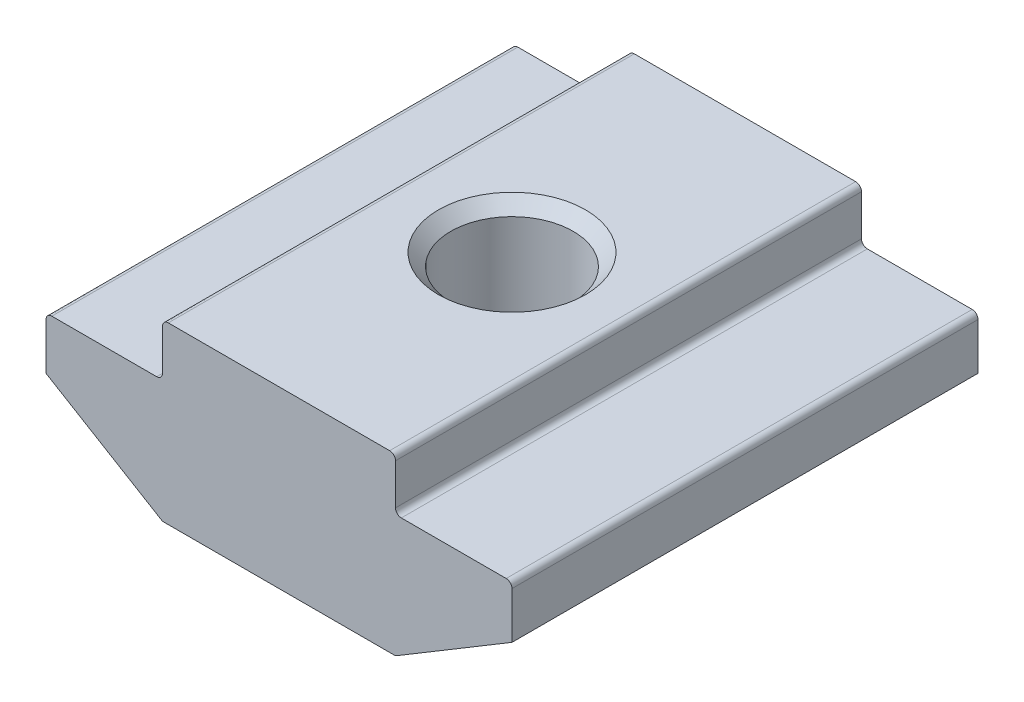
ISO-10303-21;
HEADER;
FILE_DESCRIPTION(('STEP AP214'),'2;1');
FILE_NAME('part.step','',(''),(''),'','','');
FILE_SCHEMA(('AUTOMOTIVE_DESIGN { 1 0 10303 214 1 1 1 1 }'));
ENDSEC;
DATA;
#1=APPLICATION_CONTEXT('core data for automotive mechanical design processes');
#2=APPLICATION_PROTOCOL_DEFINITION('international standard','automotive_design',2000,#1);
#3=PRODUCT_CONTEXT('',#1,'mechanical');
#4=PRODUCT('Part','Part','',(#3));
#5=PRODUCT_RELATED_PRODUCT_CATEGORY('part','',(#4));
#6=PRODUCT_DEFINITION_FORMATION('','',#4);
#7=PRODUCT_DEFINITION_CONTEXT('part definition',#1,'design');
#8=PRODUCT_DEFINITION('design','',#6,#7);
#9=PRODUCT_DEFINITION_SHAPE('','',#8);
#10=(LENGTH_UNIT() NAMED_UNIT(*) SI_UNIT(.MILLI.,.METRE.));
#11=(NAMED_UNIT(*) PLANE_ANGLE_UNIT() SI_UNIT($,.RADIAN.));
#12=(NAMED_UNIT(*) SI_UNIT($,.STERADIAN.) SOLID_ANGLE_UNIT());
#13=UNCERTAINTY_MEASURE_WITH_UNIT(LENGTH_MEASURE(1.E-05),#10,'distance_accuracy_value','');
#14=(GEOMETRIC_REPRESENTATION_CONTEXT(3) GLOBAL_UNCERTAINTY_ASSIGNED_CONTEXT((#13)) GLOBAL_UNIT_ASSIGNED_CONTEXT((#10,
#11,#12)) REPRESENTATION_CONTEXT('',''));
#15=CARTESIAN_POINT('',(0.,0.,0.));
#16=DIRECTION('',(0.,0.,1.));
#17=DIRECTION('',(1.,0.,0.));
#18=AXIS2_PLACEMENT_3D('',#15,#16,#17);
#19=CARTESIAN_POINT('',(-4.,0.,8.));
#20=DIRECTION('',(1.,0.,0.));
#21=DIRECTION('',(0.,0.,-1.));
#22=AXIS2_PLACEMENT_3D('',#19,#20,#21);
#23=PLANE('',#22);
#24=DIRECTION('',(0.,-1.,0.));
#25=VECTOR('',#24,1.);
#26=CARTESIAN_POINT('',(-4.,0.,8.));
#27=LINE('',#26,#25);
#28=CARTESIAN_POINT('',(-4.,-0.200000000000002,8.));
#29=VERTEX_POINT('',#28);
#30=CARTESIAN_POINT('',(-4.,-1.6,8.));
#31=VERTEX_POINT('',#30);
#32=EDGE_CURVE('E234',#29,#31,#27,.T.);
#33=ORIENTED_EDGE('',*,*,#32,.F.);
#34=DIRECTION('',(0.,0.,-1.));
#35=VECTOR('',#34,1.);
#36=CARTESIAN_POINT('',(-4.,-0.200000000000002,8.));
#37=LINE('',#36,#35);
#38=CARTESIAN_POINT('',(-4.,-0.200000000000002,-8.));
#39=VERTEX_POINT('',#38);
#40=EDGE_CURVE('E285',#29,#39,#37,.T.);
#41=ORIENTED_EDGE('',*,*,#40,.T.);
#42=DIRECTION('',(0.,-1.,0.));
#43=VECTOR('',#42,1.);
#44=CARTESIAN_POINT('',(-4.,0.,-8.));
#45=LINE('',#44,#43);
#46=CARTESIAN_POINT('',(-4.,-1.6,-8.));
#47=VERTEX_POINT('',#46);
#48=EDGE_CURVE('E208',#39,#47,#45,.T.);
#49=ORIENTED_EDGE('',*,*,#48,.T.);
#50=DIRECTION('',(0.,0.,-1.));
#51=VECTOR('',#50,1.);
#52=CARTESIAN_POINT('',(-4.,-1.6,8.));
#53=LINE('',#52,#51);
#54=EDGE_CURVE('E283',#47,#31,#53,.F.);
#55=ORIENTED_EDGE('',*,*,#54,.T.);
#56=EDGE_LOOP('',(#33,#41,#49,#55));
#57=FACE_BOUND('',#56,.T.);
#58=ADVANCED_FACE('F37',(#57),#23,.F.);
#59=CARTESIAN_POINT('',(-4.,-1.8,8.));
#60=DIRECTION('',(0.,-1.,0.));
#61=DIRECTION('',(1.,0.,0.));
#62=AXIS2_PLACEMENT_3D('',#59,#60,#61);
#63=PLANE('',#62);
#64=DIRECTION('',(-1.,0.,0.));
#65=VECTOR('',#64,1.);
#66=CARTESIAN_POINT('',(-4.,-1.8,-8.));
#67=LINE('',#66,#65);
#68=CARTESIAN_POINT('',(-4.2,-1.8,-8.));
#69=VERTEX_POINT('',#68);
#70=CARTESIAN_POINT('',(-7.8,-1.8,-8.));
#71=VERTEX_POINT('',#70);
#72=EDGE_CURVE('E211',#69,#71,#67,.T.);
#73=ORIENTED_EDGE('',*,*,#72,.T.);
#74=DIRECTION('',(0.,0.,-1.));
#75=VECTOR('',#74,1.);
#76=CARTESIAN_POINT('',(-7.8,-1.8,8.));
#77=LINE('',#76,#75);
#78=CARTESIAN_POINT('',(-7.8,-1.8,8.));
#79=VERTEX_POINT('',#78);
#80=EDGE_CURVE('E293',#71,#79,#77,.F.);
#81=ORIENTED_EDGE('',*,*,#80,.T.);
#82=DIRECTION('',(-1.,0.,0.));
#83=VECTOR('',#82,1.);
#84=CARTESIAN_POINT('',(-4.,-1.8,8.));
#85=LINE('',#84,#83);
#86=CARTESIAN_POINT('',(-4.2,-1.8,8.));
#87=VERTEX_POINT('',#86);
#88=EDGE_CURVE('E175',#87,#79,#85,.T.);
#89=ORIENTED_EDGE('',*,*,#88,.F.);
#90=DIRECTION('',(0.,0.,-1.));
#91=VECTOR('',#90,1.);
#92=CARTESIAN_POINT('',(-4.2,-1.8,-8.));
#93=LINE('',#92,#91);
#94=EDGE_CURVE('E290',#87,#69,#93,.T.);
#95=ORIENTED_EDGE('',*,*,#94,.T.);
#96=EDGE_LOOP('',(#73,#81,#89,#95));
#97=FACE_BOUND('',#96,.T.);
#98=ADVANCED_FACE('F313',(#97),#63,.F.);
#99=CARTESIAN_POINT('',(-8.,-1.8,8.));
#100=DIRECTION('',(1.,0.,0.));
#101=DIRECTION('',(0.,0.,-1.));
#102=AXIS2_PLACEMENT_3D('',#99,#100,#101);
#103=PLANE('',#102);
#104=DIRECTION('',(0.,-1.,0.));
#105=VECTOR('',#104,1.);
#106=CARTESIAN_POINT('',(-8.,-1.8,8.));
#107=LINE('',#106,#105);
#108=CARTESIAN_POINT('',(-8.,-2.,8.));
#109=VERTEX_POINT('',#108);
#110=CARTESIAN_POINT('',(-8.,-3.6,8.));
#111=VERTEX_POINT('',#110);
#112=EDGE_CURVE('E162',#109,#111,#107,.T.);
#113=ORIENTED_EDGE('',*,*,#112,.F.);
#114=DIRECTION('',(0.,0.,-1.));
#115=VECTOR('',#114,1.);
#116=CARTESIAN_POINT('',(-8.,-2.,8.));
#117=LINE('',#116,#115);
#118=CARTESIAN_POINT('',(-8.,-2.,-8.));
#119=VERTEX_POINT('',#118);
#120=EDGE_CURVE('E288',#109,#119,#117,.T.);
#121=ORIENTED_EDGE('',*,*,#120,.T.);
#122=DIRECTION('',(0.,-1.,0.));
#123=VECTOR('',#122,1.);
#124=CARTESIAN_POINT('',(-8.,-1.8,-8.));
#125=LINE('',#124,#123);
#126=CARTESIAN_POINT('',(-8.,-3.6,-8.));
#127=VERTEX_POINT('',#126);
#128=EDGE_CURVE('E181',#119,#127,#125,.T.);
#129=ORIENTED_EDGE('',*,*,#128,.T.);
#130=DIRECTION('',(0.,0.,-1.));
#131=VECTOR('',#130,1.);
#132=CARTESIAN_POINT('',(-8.,-3.6,8.));
#133=LINE('',#132,#131);
#134=EDGE_CURVE('E178',#111,#127,#133,.T.);
#135=ORIENTED_EDGE('',*,*,#134,.F.);
#136=EDGE_LOOP('',(#113,#121,#129,#135));
#137=FACE_BOUND('',#136,.T.);
#138=ADVANCED_FACE('F179',(#137),#103,.F.);
#139=CARTESIAN_POINT('',(-8.,-3.6,8.));
#140=DIRECTION('',(0.514495755427527,0.857492925712544,0.));
#141=DIRECTION('',(-0.857492925712544,0.514495755427527,0.));
#142=AXIS2_PLACEMENT_3D('',#139,#140,#141);
#143=PLANE('',#142);
#144=DIRECTION('',(0.857492925712544,-0.514495755427527,0.));
#145=VECTOR('',#144,1.);
#146=CARTESIAN_POINT('',(-8.,-3.6,-8.));
#147=LINE('',#146,#145);
#148=CARTESIAN_POINT('',(-4.04750235809582,-5.97149858514251,-8.));
#149=VERTEX_POINT('',#148);
#150=EDGE_CURVE('E216',#127,#149,#147,.T.);
#151=ORIENTED_EDGE('',*,*,#150,.T.);
#152=DIRECTION('',(0.,0.,-1.));
#153=VECTOR('',#152,1.);
#154=CARTESIAN_POINT('',(-4.04750235809582,-5.97149858514251,8.));
#155=LINE('',#154,#153);
#156=CARTESIAN_POINT('',(-4.04750235809582,-5.97149858514251,8.));
#157=VERTEX_POINT('',#156);
#158=EDGE_CURVE('E190',#149,#157,#155,.F.);
#159=ORIENTED_EDGE('',*,*,#158,.T.);
#160=DIRECTION('',(0.857492925712544,-0.514495755427527,0.));
#161=VECTOR('',#160,1.);
#162=CARTESIAN_POINT('',(-8.,-3.6,8.));
#163=LINE('',#162,#161);
#164=EDGE_CURVE('E167',#111,#157,#163,.T.);
#165=ORIENTED_EDGE('',*,*,#164,.F.);
#166=ORIENTED_EDGE('',*,*,#134,.T.);
#167=EDGE_LOOP('',(#151,#159,#165,#166));
#168=FACE_BOUND('',#167,.T.);
#169=ADVANCED_FACE('F188',(#168),#143,.F.);
#170=CARTESIAN_POINT('',(-4.,-6.,8.));
#171=DIRECTION('',(0.,1.,0.));
#172=DIRECTION('',(0.,0.,1.));
#173=AXIS2_PLACEMENT_3D('',#170,#171,#172);
#174=PLANE('',#173);
#175=CARTESIAN_POINT('',(0.,-6.,0.));
#176=DIRECTION('',(0.,1.,0.));
#177=DIRECTION('',(0.,0.,1.));
#178=AXIS2_PLACEMENT_3D('',#175,#176,#177);
#179=CIRCLE('',#178,2.525);
#180=CARTESIAN_POINT('',(0.,-6.,2.525));
#181=VERTEX_POINT('',#180);
#182=EDGE_CURVE('E325',#181,#181,#179,.T.);
#183=ORIENTED_EDGE('',*,*,#182,.T.);
#184=EDGE_LOOP('',(#183));
#185=FACE_BOUND('',#184,.T.);
#186=DIRECTION('',(1.,0.,0.));
#187=VECTOR('',#186,1.);
#188=CARTESIAN_POINT('',(-4.,-6.,-8.));
#189=LINE('',#188,#187);
#190=CARTESIAN_POINT('',(-3.94460320701031,-6.,-8.));
#191=VERTEX_POINT('',#190);
#192=CARTESIAN_POINT('',(3.94460320701031,-6.,-8.));
#193=VERTEX_POINT('',#192);
#194=EDGE_CURVE('E218',#191,#193,#189,.T.);
#195=ORIENTED_EDGE('',*,*,#194,.T.);
#196=DIRECTION('',(0.,0.,-1.));
#197=VECTOR('',#196,1.);
#198=CARTESIAN_POINT('',(3.94460320701031,-6.,8.));
#199=LINE('',#198,#197);
#200=CARTESIAN_POINT('',(3.94460320701031,-6.,8.));
#201=VERTEX_POINT('',#200);
#202=EDGE_CURVE('E254',#193,#201,#199,.F.);
#203=ORIENTED_EDGE('',*,*,#202,.T.);
#204=DIRECTION('',(1.,0.,0.));
#205=VECTOR('',#204,1.);
#206=CARTESIAN_POINT('',(-4.,-6.,8.));
#207=LINE('',#206,#205);
#208=CARTESIAN_POINT('',(-3.94460320701031,-6.,8.));
#209=VERTEX_POINT('',#208);
#210=EDGE_CURVE('E191',#209,#201,#207,.T.);
#211=ORIENTED_EDGE('',*,*,#210,.F.);
#212=DIRECTION('',(0.,0.,-1.));
#213=VECTOR('',#212,1.);
#214=CARTESIAN_POINT('',(-3.94460320701031,-6.,8.));
#215=LINE('',#214,#213);
#216=EDGE_CURVE('E251',#209,#191,#215,.T.);
#217=ORIENTED_EDGE('',*,*,#216,.T.);
#218=EDGE_LOOP('',(#195,#203,#211,#217));
#219=FACE_BOUND('',#218,.T.);
#220=ADVANCED_FACE('F329',(#185,#219),#174,.F.);
#221=CARTESIAN_POINT('',(8.,-3.6,8.));
#222=DIRECTION('',(-0.514495755427527,0.857492925712544,0.));
#223=DIRECTION('',(-0.857492925712544,-0.514495755427527,0.));
#224=AXIS2_PLACEMENT_3D('',#221,#222,#223);
#225=PLANE('',#224);
#226=DIRECTION('',(0.857492925712544,0.514495755427527,0.));
#227=VECTOR('',#226,1.);
#228=CARTESIAN_POINT('',(8.,-3.6,8.));
#229=LINE('',#228,#227);
#230=CARTESIAN_POINT('',(4.04750235809582,-5.97149858514251,8.));
#231=VERTEX_POINT('',#230);
#232=CARTESIAN_POINT('',(8.,-3.6,8.));
#233=VERTEX_POINT('',#232);
#234=EDGE_CURVE('E193',#231,#233,#229,.T.);
#235=ORIENTED_EDGE('',*,*,#234,.F.);
#236=DIRECTION('',(0.,0.,-1.));
#237=VECTOR('',#236,1.);
#238=CARTESIAN_POINT('',(4.04750235809582,-5.97149858514251,8.));
#239=LINE('',#238,#237);
#240=CARTESIAN_POINT('',(4.04750235809582,-5.97149858514251,-8.));
#241=VERTEX_POINT('',#240);
#242=EDGE_CURVE('E185',#231,#241,#239,.T.);
#243=ORIENTED_EDGE('',*,*,#242,.T.);
#244=DIRECTION('',(0.857492925712544,0.514495755427527,0.));
#245=VECTOR('',#244,1.);
#246=CARTESIAN_POINT('',(8.,-3.6,-8.));
#247=LINE('',#246,#245);
#248=CARTESIAN_POINT('',(8.,-3.6,-8.));
#249=VERTEX_POINT('',#248);
#250=EDGE_CURVE('E221',#241,#249,#247,.T.);
#251=ORIENTED_EDGE('',*,*,#250,.T.);
#252=DIRECTION('',(0.,0.,-1.));
#253=VECTOR('',#252,1.);
#254=CARTESIAN_POINT('',(8.,-3.6,8.));
#255=LINE('',#254,#253);
#256=EDGE_CURVE('E186',#233,#249,#255,.T.);
#257=ORIENTED_EDGE('',*,*,#256,.F.);
#258=EDGE_LOOP('',(#235,#243,#251,#257));
#259=FACE_BOUND('',#258,.T.);
#260=ADVANCED_FACE('F385',(#259),#225,.F.);
#261=CARTESIAN_POINT('',(8.,-1.8,8.));
#262=DIRECTION('',(-1.,0.,0.));
#263=DIRECTION('',(0.,0.,1.));
#264=AXIS2_PLACEMENT_3D('',#261,#262,#263);
#265=PLANE('',#264);
#266=DIRECTION('',(0.,1.,0.));
#267=VECTOR('',#266,1.);
#268=CARTESIAN_POINT('',(8.,-1.8,-8.));
#269=LINE('',#268,#267);
#270=CARTESIAN_POINT('',(8.,-2.,-8.));
#271=VERTEX_POINT('',#270);
#272=EDGE_CURVE('E223',#249,#271,#269,.T.);
#273=ORIENTED_EDGE('',*,*,#272,.T.);
#274=DIRECTION('',(0.,0.,-1.));
#275=VECTOR('',#274,1.);
#276=CARTESIAN_POINT('',(8.,-2.,8.));
#277=LINE('',#276,#275);
#278=CARTESIAN_POINT('',(8.,-2.,8.));
#279=VERTEX_POINT('',#278);
#280=EDGE_CURVE('E272',#271,#279,#277,.F.);
#281=ORIENTED_EDGE('',*,*,#280,.T.);
#282=DIRECTION('',(0.,1.,0.));
#283=VECTOR('',#282,1.);
#284=CARTESIAN_POINT('',(8.,-1.8,8.));
#285=LINE('',#284,#283);
#286=EDGE_CURVE('E198',#233,#279,#285,.T.);
#287=ORIENTED_EDGE('',*,*,#286,.F.);
#288=ORIENTED_EDGE('',*,*,#256,.T.);
#289=EDGE_LOOP('',(#273,#281,#287,#288));
#290=FACE_BOUND('',#289,.T.);
#291=ADVANCED_FACE('F380',(#290),#265,.F.);
#292=CARTESIAN_POINT('',(4.,-1.8,8.));
#293=DIRECTION('',(0.,-1.,0.));
#294=DIRECTION('',(1.,0.,0.));
#295=AXIS2_PLACEMENT_3D('',#292,#293,#294);
#296=PLANE('',#295);
#297=DIRECTION('',(-1.,0.,0.));
#298=VECTOR('',#297,1.);
#299=CARTESIAN_POINT('',(4.,-1.8,8.));
#300=LINE('',#299,#298);
#301=CARTESIAN_POINT('',(7.8,-1.8,8.));
#302=VERTEX_POINT('',#301);
#303=CARTESIAN_POINT('',(4.2,-1.8,8.));
#304=VERTEX_POINT('',#303);
#305=EDGE_CURVE('E201',#302,#304,#300,.T.);
#306=ORIENTED_EDGE('',*,*,#305,.F.);
#307=DIRECTION('',(0.,0.,-1.));
#308=VECTOR('',#307,1.);
#309=CARTESIAN_POINT('',(7.8,-1.8,8.));
#310=LINE('',#309,#308);
#311=CARTESIAN_POINT('',(7.8,-1.8,-8.));
#312=VERTEX_POINT('',#311);
#313=EDGE_CURVE('E269',#302,#312,#310,.T.);
#314=ORIENTED_EDGE('',*,*,#313,.T.);
#315=DIRECTION('',(-1.,0.,0.));
#316=VECTOR('',#315,1.);
#317=CARTESIAN_POINT('',(4.,-1.8,-8.));
#318=LINE('',#317,#316);
#319=CARTESIAN_POINT('',(4.2,-1.8,-8.));
#320=VERTEX_POINT('',#319);
#321=EDGE_CURVE('E226',#312,#320,#318,.T.);
#322=ORIENTED_EDGE('',*,*,#321,.T.);
#323=DIRECTION('',(0.,0.,-1.));
#324=VECTOR('',#323,1.);
#325=CARTESIAN_POINT('',(4.2,-1.8,8.));
#326=LINE('',#325,#324);
#327=EDGE_CURVE('E267',#320,#304,#326,.F.);
#328=ORIENTED_EDGE('',*,*,#327,.T.);
#329=EDGE_LOOP('',(#306,#314,#322,#328));
#330=FACE_BOUND('',#329,.T.);
#331=ADVANCED_FACE('F372',(#330),#296,.F.);
#332=CARTESIAN_POINT('',(4.,0.,8.));
#333=DIRECTION('',(-1.,0.,0.));
#334=DIRECTION('',(0.,0.,1.));
#335=AXIS2_PLACEMENT_3D('',#332,#333,#334);
#336=PLANE('',#335);
#337=DIRECTION('',(0.,1.,0.));
#338=VECTOR('',#337,1.);
#339=CARTESIAN_POINT('',(4.,0.,8.));
#340=LINE('',#339,#338);
#341=CARTESIAN_POINT('',(4.,-1.6,8.));
#342=VERTEX_POINT('',#341);
#343=CARTESIAN_POINT('',(4.,-0.199999999999998,8.));
#344=VERTEX_POINT('',#343);
#345=EDGE_CURVE('E204',#342,#344,#340,.T.);
#346=ORIENTED_EDGE('',*,*,#345,.F.);
#347=DIRECTION('',(0.,0.,-1.));
#348=VECTOR('',#347,1.);
#349=CARTESIAN_POINT('',(4.,-1.6,-8.));
#350=LINE('',#349,#348);
#351=CARTESIAN_POINT('',(4.,-1.6,-8.));
#352=VERTEX_POINT('',#351);
#353=EDGE_CURVE('E276',#342,#352,#350,.T.);
#354=ORIENTED_EDGE('',*,*,#353,.T.);
#355=DIRECTION('',(0.,1.,0.));
#356=VECTOR('',#355,1.);
#357=CARTESIAN_POINT('',(4.,0.,-8.));
#358=LINE('',#357,#356);
#359=CARTESIAN_POINT('',(4.,-0.199999999999998,-8.));
#360=VERTEX_POINT('',#359);
#361=EDGE_CURVE('E229',#352,#360,#358,.T.);
#362=ORIENTED_EDGE('',*,*,#361,.T.);
#363=DIRECTION('',(0.,0.,-1.));
#364=VECTOR('',#363,1.);
#365=CARTESIAN_POINT('',(4.,-0.199999999999998,8.));
#366=LINE('',#365,#364);
#367=EDGE_CURVE('E274',#360,#344,#366,.F.);
#368=ORIENTED_EDGE('',*,*,#367,.T.);
#369=EDGE_LOOP('',(#346,#354,#362,#368));
#370=FACE_BOUND('',#369,.T.);
#371=ADVANCED_FACE('F353',(#370),#336,.F.);
#372=CARTESIAN_POINT('',(4.,0.,8.));
#373=DIRECTION('',(0.,-1.,0.));
#374=DIRECTION('',(1.,0.,0.));
#375=AXIS2_PLACEMENT_3D('',#372,#373,#374);
#376=PLANE('',#375);
#377=CARTESIAN_POINT('',(0.,0.,0.));
#378=DIRECTION('',(0.,1.,0.));
#379=DIRECTION('',(0.,0.,1.));
#380=AXIS2_PLACEMENT_3D('',#377,#378,#379);
#381=CIRCLE('',#380,2.525);
#382=CARTESIAN_POINT('',(0.,0.,2.525));
#383=VERTEX_POINT('',#382);
#384=EDGE_CURVE('E322',#383,#383,#381,.T.);
#385=ORIENTED_EDGE('',*,*,#384,.F.);
#386=EDGE_LOOP('',(#385));
#387=FACE_BOUND('',#386,.T.);
#388=DIRECTION('',(-1.,0.,0.));
#389=VECTOR('',#388,1.);
#390=CARTESIAN_POINT('',(4.,0.,8.));
#391=LINE('',#390,#389);
#392=CARTESIAN_POINT('',(3.8,0.,8.));
#393=VERTEX_POINT('',#392);
#394=CARTESIAN_POINT('',(-3.8,0.,8.));
#395=VERTEX_POINT('',#394);
#396=EDGE_CURVE('E206',#393,#395,#391,.T.);
#397=ORIENTED_EDGE('',*,*,#396,.F.);
#398=DIRECTION('',(0.,0.,-1.));
#399=VECTOR('',#398,1.);
#400=CARTESIAN_POINT('',(3.8,0.,8.));
#401=LINE('',#400,#399);
#402=CARTESIAN_POINT('',(3.8,0.,-8.));
#403=VERTEX_POINT('',#402);
#404=EDGE_CURVE('E280',#393,#403,#401,.T.);
#405=ORIENTED_EDGE('',*,*,#404,.T.);
#406=DIRECTION('',(-1.,0.,0.));
#407=VECTOR('',#406,1.);
#408=CARTESIAN_POINT('',(4.,0.,-8.));
#409=LINE('',#408,#407);
#410=CARTESIAN_POINT('',(-3.8,0.,-8.));
#411=VERTEX_POINT('',#410);
#412=EDGE_CURVE('E232',#403,#411,#409,.T.);
#413=ORIENTED_EDGE('',*,*,#412,.T.);
#414=DIRECTION('',(0.,0.,-1.));
#415=VECTOR('',#414,1.);
#416=CARTESIAN_POINT('',(-3.8,0.,8.));
#417=LINE('',#416,#415);
#418=EDGE_CURVE('E52',#411,#395,#417,.F.);
#419=ORIENTED_EDGE('',*,*,#418,.T.);
#420=EDGE_LOOP('',(#397,#405,#413,#419));
#421=FACE_BOUND('',#420,.T.);
#422=ADVANCED_FACE('F351',(#387,#421),#376,.F.);
#423=CARTESIAN_POINT('',(0.,0.,8.));
#424=DIRECTION('',(0.,0.,-1.));
#425=DIRECTION('',(-1.,0.,0.));
#426=AXIS2_PLACEMENT_3D('',#423,#424,#425);
#427=PLANE('',#426);
#428=ORIENTED_EDGE('',*,*,#210,.T.);
#429=CARTESIAN_POINT('',(3.94460320701031,-5.8,8.));
#430=DIRECTION('',(0.,0.,-1.));
#431=DIRECTION('',(-1.,0.,0.));
#432=AXIS2_PLACEMENT_3D('',#429,#430,#431);
#433=CIRCLE('',#432,0.2);
#434=EDGE_CURVE('E264',#201,#231,#433,.F.);
#435=ORIENTED_EDGE('',*,*,#434,.T.);
#436=ORIENTED_EDGE('',*,*,#234,.T.);
#437=ORIENTED_EDGE('',*,*,#286,.T.);
#438=CARTESIAN_POINT('',(7.8,-2.,8.));
#439=DIRECTION('',(0.,0.,-1.));
#440=DIRECTION('',(-1.,0.,0.));
#441=AXIS2_PLACEMENT_3D('',#438,#439,#440);
#442=CIRCLE('',#441,0.2);
#443=EDGE_CURVE('E260',#279,#302,#442,.F.);
#444=ORIENTED_EDGE('',*,*,#443,.T.);
#445=ORIENTED_EDGE('',*,*,#305,.T.);
#446=CARTESIAN_POINT('',(4.2,-1.6,8.));
#447=DIRECTION('',(0.,0.,-1.));
#448=DIRECTION('',(-1.,0.,0.));
#449=AXIS2_PLACEMENT_3D('',#446,#447,#448);
#450=CIRCLE('',#449,0.2);
#451=EDGE_CURVE('E297',#304,#342,#450,.T.);
#452=ORIENTED_EDGE('',*,*,#451,.T.);
#453=ORIENTED_EDGE('',*,*,#345,.T.);
#454=CARTESIAN_POINT('',(3.8,-0.199999999999998,8.));
#455=DIRECTION('',(0.,0.,-1.));
#456=DIRECTION('',(-1.,0.,0.));
#457=AXIS2_PLACEMENT_3D('',#454,#455,#456);
#458=CIRCLE('',#457,0.2);
#459=EDGE_CURVE('E59',#344,#393,#458,.F.);
#460=ORIENTED_EDGE('',*,*,#459,.T.);
#461=ORIENTED_EDGE('',*,*,#396,.T.);
#462=CARTESIAN_POINT('',(-3.8,-0.200000000000002,8.));
#463=DIRECTION('',(0.,0.,-1.));
#464=DIRECTION('',(-1.,0.,0.));
#465=AXIS2_PLACEMENT_3D('',#462,#463,#464);
#466=CIRCLE('',#465,0.2);
#467=EDGE_CURVE('E257',#395,#29,#466,.F.);
#468=ORIENTED_EDGE('',*,*,#467,.T.);
#469=ORIENTED_EDGE('',*,*,#32,.T.);
#470=CARTESIAN_POINT('',(-4.2,-1.6,8.));
#471=DIRECTION('',(0.,0.,-1.));
#472=DIRECTION('',(-1.,0.,0.));
#473=AXIS2_PLACEMENT_3D('',#470,#471,#472);
#474=CIRCLE('',#473,0.2);
#475=EDGE_CURVE('E11',#31,#87,#474,.T.);
#476=ORIENTED_EDGE('',*,*,#475,.T.);
#477=ORIENTED_EDGE('',*,*,#88,.T.);
#478=CARTESIAN_POINT('',(-7.8,-2.,8.));
#479=DIRECTION('',(0.,0.,-1.));
#480=DIRECTION('',(-1.,0.,0.));
#481=AXIS2_PLACEMENT_3D('',#478,#479,#480);
#482=CIRCLE('',#481,0.2);
#483=EDGE_CURVE('E171',#79,#109,#482,.F.);
#484=ORIENTED_EDGE('',*,*,#483,.T.);
#485=ORIENTED_EDGE('',*,*,#112,.T.);
#486=ORIENTED_EDGE('',*,*,#164,.T.);
#487=CARTESIAN_POINT('',(-3.94460320701031,-5.8,8.));
#488=DIRECTION('',(0.,0.,-1.));
#489=DIRECTION('',(-1.,0.,0.));
#490=AXIS2_PLACEMENT_3D('',#487,#488,#489);
#491=CIRCLE('',#490,0.2);
#492=EDGE_CURVE('E262',#157,#209,#491,.F.);
#493=ORIENTED_EDGE('',*,*,#492,.T.);
#494=EDGE_LOOP('',(#428,#435,#436,#437,#444,#445,#452,#453,#460,#461,#468,#469,#476,#477,#484,
#485,#486,#493));
#495=FACE_BOUND('',#494,.T.);
#496=ADVANCED_FACE('F165',(#495),#427,.F.);
#497=CARTESIAN_POINT('',(0.,0.,-8.));
#498=DIRECTION('',(0.,0.,-1.));
#499=DIRECTION('',(-1.,0.,0.));
#500=AXIS2_PLACEMENT_3D('',#497,#498,#499);
#501=PLANE('',#500);
#502=ORIENTED_EDGE('',*,*,#250,.F.);
#503=CARTESIAN_POINT('',(3.94460320701031,-5.8,-8.));
#504=DIRECTION('',(0.,0.,-1.));
#505=DIRECTION('',(-1.,0.,0.));
#506=AXIS2_PLACEMENT_3D('',#503,#504,#505);
#507=CIRCLE('',#506,0.2);
#508=EDGE_CURVE('E249',#241,#193,#507,.T.);
#509=ORIENTED_EDGE('',*,*,#508,.T.);
#510=ORIENTED_EDGE('',*,*,#194,.F.);
#511=CARTESIAN_POINT('',(-3.94460320701031,-5.8,-8.));
#512=DIRECTION('',(0.,0.,-1.));
#513=DIRECTION('',(-1.,0.,0.));
#514=AXIS2_PLACEMENT_3D('',#511,#512,#513);
#515=CIRCLE('',#514,0.2);
#516=EDGE_CURVE('E247',#191,#149,#515,.T.);
#517=ORIENTED_EDGE('',*,*,#516,.T.);
#518=ORIENTED_EDGE('',*,*,#150,.F.);
#519=ORIENTED_EDGE('',*,*,#128,.F.);
#520=CARTESIAN_POINT('',(-7.8,-2.,-8.));
#521=DIRECTION('',(0.,0.,-1.));
#522=DIRECTION('',(-1.,0.,0.));
#523=AXIS2_PLACEMENT_3D('',#520,#521,#522);
#524=CIRCLE('',#523,0.2);
#525=EDGE_CURVE('E239',#119,#71,#524,.T.);
#526=ORIENTED_EDGE('',*,*,#525,.T.);
#527=ORIENTED_EDGE('',*,*,#72,.F.);
#528=CARTESIAN_POINT('',(-4.2,-1.6,-8.));
#529=DIRECTION('',(0.,0.,-1.));
#530=DIRECTION('',(-1.,0.,0.));
#531=AXIS2_PLACEMENT_3D('',#528,#529,#530);
#532=CIRCLE('',#531,0.2);
#533=EDGE_CURVE('E45',#69,#47,#532,.F.);
#534=ORIENTED_EDGE('',*,*,#533,.T.);
#535=ORIENTED_EDGE('',*,*,#48,.F.);
#536=CARTESIAN_POINT('',(-3.8,-0.200000000000002,-8.));
#537=DIRECTION('',(0.,0.,-1.));
#538=DIRECTION('',(-1.,0.,0.));
#539=AXIS2_PLACEMENT_3D('',#536,#537,#538);
#540=CIRCLE('',#539,0.2);
#541=EDGE_CURVE('E241',#39,#411,#540,.T.);
#542=ORIENTED_EDGE('',*,*,#541,.T.);
#543=ORIENTED_EDGE('',*,*,#412,.F.);
#544=CARTESIAN_POINT('',(3.8,-0.199999999999998,-8.));
#545=DIRECTION('',(0.,0.,-1.));
#546=DIRECTION('',(-1.,0.,0.));
#547=AXIS2_PLACEMENT_3D('',#544,#545,#546);
#548=CIRCLE('',#547,0.2);
#549=EDGE_CURVE('E243',#403,#360,#548,.T.);
#550=ORIENTED_EDGE('',*,*,#549,.T.);
#551=ORIENTED_EDGE('',*,*,#361,.F.);
#552=CARTESIAN_POINT('',(4.2,-1.6,-8.));
#553=DIRECTION('',(0.,0.,-1.));
#554=DIRECTION('',(-1.,0.,0.));
#555=AXIS2_PLACEMENT_3D('',#552,#553,#554);
#556=CIRCLE('',#555,0.2);
#557=EDGE_CURVE('E295',#352,#320,#556,.F.);
#558=ORIENTED_EDGE('',*,*,#557,.T.);
#559=ORIENTED_EDGE('',*,*,#321,.F.);
#560=CARTESIAN_POINT('',(7.8,-2.,-8.));
#561=DIRECTION('',(0.,0.,-1.));
#562=DIRECTION('',(-1.,0.,0.));
#563=AXIS2_PLACEMENT_3D('',#560,#561,#562);
#564=CIRCLE('',#563,0.2);
#565=EDGE_CURVE('E245',#312,#271,#564,.T.);
#566=ORIENTED_EDGE('',*,*,#565,.T.);
#567=ORIENTED_EDGE('',*,*,#272,.F.);
#568=EDGE_LOOP('',(#502,#509,#510,#517,#518,#519,#526,#527,#534,#535,#542,#543,#550,#551,#558,
#559,#566,#567));
#569=FACE_BOUND('',#568,.T.);
#570=ADVANCED_FACE('F302',(#569),#501,.T.);
#571=CARTESIAN_POINT('',(0.,-5.575,0.));
#572=DIRECTION('',(0.,-1.,0.));
#573=DIRECTION('',(0.,0.,-1.));
#574=AXIS2_PLACEMENT_3D('',#571,#572,#573);
#575=CONICAL_SURFACE('',#574,2.1,0.785398163397446);
#576=ORIENTED_EDGE('',*,*,#182,.F.);
#577=EDGE_LOOP('',(#576));
#578=FACE_BOUND('',#577,.T.);
#579=CARTESIAN_POINT('',(0.,-5.575,0.));
#580=DIRECTION('',(0.,1.,0.));
#581=DIRECTION('',(0.,0.,1.));
#582=AXIS2_PLACEMENT_3D('',#579,#580,#581);
#583=CIRCLE('',#582,2.1);
#584=CARTESIAN_POINT('',(0.,-5.575,2.1));
#585=VERTEX_POINT('',#584);
#586=EDGE_CURVE('E212',#585,#585,#583,.T.);
#587=ORIENTED_EDGE('',*,*,#586,.T.);
#588=EDGE_LOOP('',(#587));
#589=FACE_BOUND('',#588,.T.);
#590=ADVANCED_FACE('F332',(#578,#589),#575,.F.);
#591=CARTESIAN_POINT('',(0.,0.,0.));
#592=DIRECTION('',(0.,1.,0.));
#593=DIRECTION('',(0.,0.,1.));
#594=AXIS2_PLACEMENT_3D('',#591,#592,#593);
#595=CYLINDRICAL_SURFACE('',#594,2.1);
#596=ORIENTED_EDGE('',*,*,#586,.F.);
#597=EDGE_LOOP('',(#596));
#598=FACE_BOUND('',#597,.T.);
#599=CARTESIAN_POINT('',(0.,-0.425,0.));
#600=DIRECTION('',(0.,1.,0.));
#601=DIRECTION('',(0.,0.,1.));
#602=AXIS2_PLACEMENT_3D('',#599,#600,#601);
#603=CIRCLE('',#602,2.1);
#604=CARTESIAN_POINT('',(0.,-0.425,2.1));
#605=VERTEX_POINT('',#604);
#606=EDGE_CURVE('E319',#605,#605,#603,.T.);
#607=ORIENTED_EDGE('',*,*,#606,.T.);
#608=EDGE_LOOP('',(#607));
#609=FACE_BOUND('',#608,.T.);
#610=ADVANCED_FACE('F335',(#598,#609),#595,.F.);
#611=CARTESIAN_POINT('',(0.,0.,0.));
#612=DIRECTION('',(0.,1.,0.));
#613=DIRECTION('',(0.,0.,1.));
#614=AXIS2_PLACEMENT_3D('',#611,#612,#613);
#615=CONICAL_SURFACE('',#614,2.525,0.785398163397449);
#616=ORIENTED_EDGE('',*,*,#606,.F.);
#617=EDGE_LOOP('',(#616));
#618=FACE_BOUND('',#617,.T.);
#619=ORIENTED_EDGE('',*,*,#384,.T.);
#620=EDGE_LOOP('',(#619));
#621=FACE_BOUND('',#620,.T.);
#622=ADVANCED_FACE('F341',(#618,#621),#615,.F.);
#623=CARTESIAN_POINT('',(3.94460320701031,-5.8,8.));
#624=DIRECTION('',(0.,0.,-1.));
#625=DIRECTION('',(-1.,0.,0.));
#626=AXIS2_PLACEMENT_3D('',#623,#624,#625);
#627=CYLINDRICAL_SURFACE('',#626,0.2);
#628=ORIENTED_EDGE('',*,*,#434,.F.);
#629=ORIENTED_EDGE('',*,*,#202,.F.);
#630=ORIENTED_EDGE('',*,*,#508,.F.);
#631=ORIENTED_EDGE('',*,*,#242,.F.);
#632=EDGE_LOOP('',(#628,#629,#630,#631));
#633=FACE_BOUND('',#632,.T.);
#634=ADVANCED_FACE('F347',(#633),#627,.T.);
#635=CARTESIAN_POINT('',(-3.94460320701031,-5.8,8.));
#636=DIRECTION('',(0.,0.,-1.));
#637=DIRECTION('',(-1.,0.,0.));
#638=AXIS2_PLACEMENT_3D('',#635,#636,#637);
#639=CYLINDRICAL_SURFACE('',#638,0.2);
#640=ORIENTED_EDGE('',*,*,#492,.F.);
#641=ORIENTED_EDGE('',*,*,#158,.F.);
#642=ORIENTED_EDGE('',*,*,#516,.F.);
#643=ORIENTED_EDGE('',*,*,#216,.F.);
#644=EDGE_LOOP('',(#640,#641,#642,#643));
#645=FACE_BOUND('',#644,.T.);
#646=ADVANCED_FACE('F394',(#645),#639,.T.);
#647=CARTESIAN_POINT('',(7.8,-2.,8.));
#648=DIRECTION('',(0.,0.,-1.));
#649=DIRECTION('',(-1.,0.,0.));
#650=AXIS2_PLACEMENT_3D('',#647,#648,#649);
#651=CYLINDRICAL_SURFACE('',#650,0.2);
#652=ORIENTED_EDGE('',*,*,#443,.F.);
#653=ORIENTED_EDGE('',*,*,#280,.F.);
#654=ORIENTED_EDGE('',*,*,#565,.F.);
#655=ORIENTED_EDGE('',*,*,#313,.F.);
#656=EDGE_LOOP('',(#652,#653,#654,#655));
#657=FACE_BOUND('',#656,.T.);
#658=ADVANCED_FACE('F376',(#657),#651,.T.);
#659=CARTESIAN_POINT('',(4.2,-1.6,8.));
#660=DIRECTION('',(0.,0.,1.));
#661=DIRECTION('',(1.,0.,0.));
#662=AXIS2_PLACEMENT_3D('',#659,#660,#661);
#663=CYLINDRICAL_SURFACE('',#662,0.2);
#664=ORIENTED_EDGE('',*,*,#451,.F.);
#665=ORIENTED_EDGE('',*,*,#327,.F.);
#666=ORIENTED_EDGE('',*,*,#557,.F.);
#667=ORIENTED_EDGE('',*,*,#353,.F.);
#668=EDGE_LOOP('',(#664,#665,#666,#667));
#669=FACE_BOUND('',#668,.T.);
#670=ADVANCED_FACE('F367',(#669),#663,.F.);
#671=CARTESIAN_POINT('',(3.8,-0.199999999999998,8.));
#672=DIRECTION('',(0.,0.,-1.));
#673=DIRECTION('',(-1.,0.,0.));
#674=AXIS2_PLACEMENT_3D('',#671,#672,#673);
#675=CYLINDRICAL_SURFACE('',#674,0.2);
#676=ORIENTED_EDGE('',*,*,#459,.F.);
#677=ORIENTED_EDGE('',*,*,#367,.F.);
#678=ORIENTED_EDGE('',*,*,#549,.F.);
#679=ORIENTED_EDGE('',*,*,#404,.F.);
#680=EDGE_LOOP('',(#676,#677,#678,#679));
#681=FACE_BOUND('',#680,.T.);
#682=ADVANCED_FACE('F359',(#681),#675,.T.);
#683=CARTESIAN_POINT('',(-3.8,-0.200000000000002,8.));
#684=DIRECTION('',(0.,0.,-1.));
#685=DIRECTION('',(-1.,0.,0.));
#686=AXIS2_PLACEMENT_3D('',#683,#684,#685);
#687=CYLINDRICAL_SURFACE('',#686,0.2);
#688=ORIENTED_EDGE('',*,*,#467,.F.);
#689=ORIENTED_EDGE('',*,*,#418,.F.);
#690=ORIENTED_EDGE('',*,*,#541,.F.);
#691=ORIENTED_EDGE('',*,*,#40,.F.);
#692=EDGE_LOOP('',(#688,#689,#690,#691));
#693=FACE_BOUND('',#692,.T.);
#694=ADVANCED_FACE('F398',(#693),#687,.T.);
#695=CARTESIAN_POINT('',(-7.8,-2.,8.));
#696=DIRECTION('',(0.,0.,-1.));
#697=DIRECTION('',(-1.,0.,0.));
#698=AXIS2_PLACEMENT_3D('',#695,#696,#697);
#699=CYLINDRICAL_SURFACE('',#698,0.2);
#700=ORIENTED_EDGE('',*,*,#483,.F.);
#701=ORIENTED_EDGE('',*,*,#80,.F.);
#702=ORIENTED_EDGE('',*,*,#525,.F.);
#703=ORIENTED_EDGE('',*,*,#120,.F.);
#704=EDGE_LOOP('',(#700,#701,#702,#703));
#705=FACE_BOUND('',#704,.T.);
#706=ADVANCED_FACE('F396',(#705),#699,.T.);
#707=CARTESIAN_POINT('',(-4.2,-1.6,8.));
#708=DIRECTION('',(0.,0.,1.));
#709=DIRECTION('',(1.,0.,0.));
#710=AXIS2_PLACEMENT_3D('',#707,#708,#709);
#711=CYLINDRICAL_SURFACE('',#710,0.2);
#712=ORIENTED_EDGE('',*,*,#475,.F.);
#713=ORIENTED_EDGE('',*,*,#54,.F.);
#714=ORIENTED_EDGE('',*,*,#533,.F.);
#715=ORIENTED_EDGE('',*,*,#94,.F.);
#716=EDGE_LOOP('',(#712,#713,#714,#715));
#717=FACE_BOUND('',#716,.T.);
#718=ADVANCED_FACE('F39',(#717),#711,.F.);
#719=CLOSED_SHELL('',(#58,#98,#138,#169,#220,#260,#291,#331,#371,#422,#496,#570,#590,#610,#622,
#634,#646,#658,#670,#682,#694,#706,#718));
#720=MANIFOLD_SOLID_BREP('B2',#719);
#721=ADVANCED_BREP_SHAPE_REPRESENTATION('',(#18,#720),#14);
#722=SHAPE_DEFINITION_REPRESENTATION(#9,#721);
ENDSEC;
END-ISO-10303-21;
